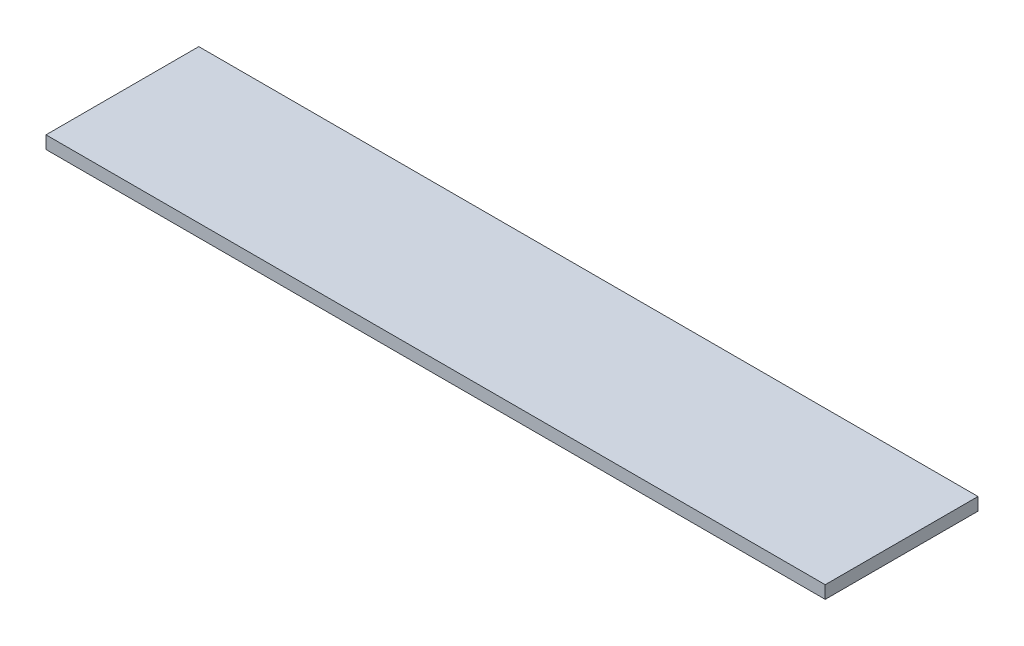
ISO-10303-21;
HEADER;
FILE_DESCRIPTION(('STEP AP214'),'2;1');
FILE_NAME('part.step','',(''),(''),'','','');
FILE_SCHEMA(('AUTOMOTIVE_DESIGN { 1 0 10303 214 1 1 1 1 }'));
ENDSEC;
DATA;
#1=APPLICATION_CONTEXT('core data for automotive mechanical design processes');
#2=APPLICATION_PROTOCOL_DEFINITION('international standard','automotive_design',2000,#1);
#3=PRODUCT_CONTEXT('',#1,'mechanical');
#4=PRODUCT('Part','Part','',(#3));
#5=PRODUCT_RELATED_PRODUCT_CATEGORY('part','',(#4));
#6=PRODUCT_DEFINITION_FORMATION('','',#4);
#7=PRODUCT_DEFINITION_CONTEXT('part definition',#1,'design');
#8=PRODUCT_DEFINITION('design','',#6,#7);
#9=PRODUCT_DEFINITION_SHAPE('','',#8);
#10=(LENGTH_UNIT() NAMED_UNIT(*) SI_UNIT(.MILLI.,.METRE.));
#11=(NAMED_UNIT(*) PLANE_ANGLE_UNIT() SI_UNIT($,.RADIAN.));
#12=(NAMED_UNIT(*) SI_UNIT($,.STERADIAN.) SOLID_ANGLE_UNIT());
#13=UNCERTAINTY_MEASURE_WITH_UNIT(LENGTH_MEASURE(1.E-05),#10,'distance_accuracy_value','');
#14=(GEOMETRIC_REPRESENTATION_CONTEXT(3) GLOBAL_UNCERTAINTY_ASSIGNED_CONTEXT((#13)) GLOBAL_UNIT_ASSIGNED_CONTEXT((#10,
#11,#12)) REPRESENTATION_CONTEXT('',''));
#15=CARTESIAN_POINT('',(0.,0.,0.));
#16=DIRECTION('',(0.,0.,1.));
#17=DIRECTION('',(1.,0.,0.));
#18=AXIS2_PLACEMENT_3D('',#15,#16,#17);
#19=CARTESIAN_POINT('',(-388.62,12.7,-76.2));
#20=DIRECTION('',(1.,0.,0.));
#21=DIRECTION('',(0.,0.,-1.));
#22=AXIS2_PLACEMENT_3D('',#19,#20,#21);
#23=PLANE('',#22);
#24=DIRECTION('',(0.,0.,1.));
#25=VECTOR('',#24,1.);
#26=CARTESIAN_POINT('',(-388.62,0.,-76.2));
#27=LINE('',#26,#25);
#28=CARTESIAN_POINT('',(-388.62,0.,-76.2));
#29=VERTEX_POINT('',#28);
#30=CARTESIAN_POINT('',(-388.62,0.,76.2));
#31=VERTEX_POINT('',#30);
#32=EDGE_CURVE('E111',#29,#31,#27,.T.);
#33=ORIENTED_EDGE('',*,*,#32,.T.);
#34=DIRECTION('',(0.,-1.,0.));
#35=VECTOR('',#34,1.);
#36=CARTESIAN_POINT('',(-388.62,12.7,76.2));
#37=LINE('',#36,#35);
#38=CARTESIAN_POINT('',(-388.62,12.7,76.2));
#39=VERTEX_POINT('',#38);
#40=EDGE_CURVE('E11',#39,#31,#37,.T.);
#41=ORIENTED_EDGE('',*,*,#40,.F.);
#42=DIRECTION('',(0.,0.,1.));
#43=VECTOR('',#42,1.);
#44=CARTESIAN_POINT('',(-388.62,12.7,-76.2));
#45=LINE('',#44,#43);
#46=CARTESIAN_POINT('',(-388.62,12.7,-76.2));
#47=VERTEX_POINT('',#46);
#48=EDGE_CURVE('E93',#47,#39,#45,.T.);
#49=ORIENTED_EDGE('',*,*,#48,.F.);
#50=DIRECTION('',(0.,-1.,0.));
#51=VECTOR('',#50,1.);
#52=CARTESIAN_POINT('',(-388.62,12.7,-76.2));
#53=LINE('',#52,#51);
#54=EDGE_CURVE('E60',#47,#29,#53,.T.);
#55=ORIENTED_EDGE('',*,*,#54,.T.);
#56=EDGE_LOOP('',(#33,#41,#49,#55));
#57=FACE_BOUND('',#56,.T.);
#58=ADVANCED_FACE('F43',(#57),#23,.F.);
#59=CARTESIAN_POINT('',(-388.62,12.7,76.2));
#60=DIRECTION('',(0.,0.,-1.));
#61=DIRECTION('',(-1.,0.,0.));
#62=AXIS2_PLACEMENT_3D('',#59,#60,#61);
#63=PLANE('',#62);
#64=DIRECTION('',(1.,0.,0.));
#65=VECTOR('',#64,1.);
#66=CARTESIAN_POINT('',(-388.62,0.,76.2));
#67=LINE('',#66,#65);
#68=CARTESIAN_POINT('',(388.62,0.,76.2));
#69=VERTEX_POINT('',#68);
#70=EDGE_CURVE('E99',#31,#69,#67,.T.);
#71=ORIENTED_EDGE('',*,*,#70,.T.);
#72=DIRECTION('',(0.,-1.,0.));
#73=VECTOR('',#72,1.);
#74=CARTESIAN_POINT('',(388.62,12.7,76.2));
#75=LINE('',#74,#73);
#76=CARTESIAN_POINT('',(388.62,12.7,76.2));
#77=VERTEX_POINT('',#76);
#78=EDGE_CURVE('E52',#77,#69,#75,.T.);
#79=ORIENTED_EDGE('',*,*,#78,.F.);
#80=DIRECTION('',(1.,0.,0.));
#81=VECTOR('',#80,1.);
#82=CARTESIAN_POINT('',(-388.62,12.7,76.2));
#83=LINE('',#82,#81);
#84=EDGE_CURVE('E85',#39,#77,#83,.T.);
#85=ORIENTED_EDGE('',*,*,#84,.F.);
#86=ORIENTED_EDGE('',*,*,#40,.T.);
#87=EDGE_LOOP('',(#71,#79,#85,#86));
#88=FACE_BOUND('',#87,.T.);
#89=ADVANCED_FACE('F98',(#88),#63,.F.);
#90=CARTESIAN_POINT('',(388.62,12.7,-76.2));
#91=DIRECTION('',(1.,0.,0.));
#92=DIRECTION('',(0.,0.,-1.));
#93=AXIS2_PLACEMENT_3D('',#90,#91,#92);
#94=PLANE('',#93);
#95=DIRECTION('',(0.,0.,1.));
#96=VECTOR('',#95,1.);
#97=CARTESIAN_POINT('',(388.62,0.,-76.2));
#98=LINE('',#97,#96);
#99=CARTESIAN_POINT('',(388.62,0.,-76.2));
#100=VERTEX_POINT('',#99);
#101=EDGE_CURVE('E116',#100,#69,#98,.T.);
#102=ORIENTED_EDGE('',*,*,#101,.F.);
#103=DIRECTION('',(0.,-1.,0.));
#104=VECTOR('',#103,1.);
#105=CARTESIAN_POINT('',(388.62,12.7,-76.2));
#106=LINE('',#105,#104);
#107=CARTESIAN_POINT('',(388.62,12.7,-76.2));
#108=VERTEX_POINT('',#107);
#109=EDGE_CURVE('E74',#108,#100,#106,.T.);
#110=ORIENTED_EDGE('',*,*,#109,.F.);
#111=DIRECTION('',(0.,0.,1.));
#112=VECTOR('',#111,1.);
#113=CARTESIAN_POINT('',(388.62,12.7,-76.2));
#114=LINE('',#113,#112);
#115=EDGE_CURVE('E92',#108,#77,#114,.T.);
#116=ORIENTED_EDGE('',*,*,#115,.T.);
#117=ORIENTED_EDGE('',*,*,#78,.T.);
#118=EDGE_LOOP('',(#102,#110,#116,#117));
#119=FACE_BOUND('',#118,.T.);
#120=ADVANCED_FACE('F103',(#119),#94,.T.);
#121=CARTESIAN_POINT('',(-388.62,12.7,-76.2));
#122=DIRECTION('',(0.,0.,-1.));
#123=DIRECTION('',(-1.,0.,0.));
#124=AXIS2_PLACEMENT_3D('',#121,#122,#123);
#125=PLANE('',#124);
#126=DIRECTION('',(1.,0.,0.));
#127=VECTOR('',#126,1.);
#128=CARTESIAN_POINT('',(-388.62,0.,-76.2));
#129=LINE('',#128,#127);
#130=EDGE_CURVE('E119',#29,#100,#129,.T.);
#131=ORIENTED_EDGE('',*,*,#130,.F.);
#132=ORIENTED_EDGE('',*,*,#54,.F.);
#133=DIRECTION('',(1.,0.,0.));
#134=VECTOR('',#133,1.);
#135=CARTESIAN_POINT('',(-388.62,12.7,-76.2));
#136=LINE('',#135,#134);
#137=EDGE_CURVE('E105',#47,#108,#136,.T.);
#138=ORIENTED_EDGE('',*,*,#137,.T.);
#139=ORIENTED_EDGE('',*,*,#109,.T.);
#140=EDGE_LOOP('',(#131,#132,#138,#139));
#141=FACE_BOUND('',#140,.T.);
#142=ADVANCED_FACE('F129',(#141),#125,.T.);
#143=CARTESIAN_POINT('',(0.,12.7,0.));
#144=DIRECTION('',(0.,1.,0.));
#145=DIRECTION('',(0.,0.,1.));
#146=AXIS2_PLACEMENT_3D('',#143,#144,#145);
#147=PLANE('',#146);
#148=ORIENTED_EDGE('',*,*,#48,.T.);
#149=ORIENTED_EDGE('',*,*,#84,.T.);
#150=ORIENTED_EDGE('',*,*,#115,.F.);
#151=ORIENTED_EDGE('',*,*,#137,.F.);
#152=EDGE_LOOP('',(#148,#149,#150,#151));
#153=FACE_BOUND('',#152,.T.);
#154=ADVANCED_FACE('F89',(#153),#147,.T.);
#155=CARTESIAN_POINT('',(0.,0.,0.));
#156=DIRECTION('',(0.,1.,0.));
#157=DIRECTION('',(0.,0.,1.));
#158=AXIS2_PLACEMENT_3D('',#155,#156,#157);
#159=PLANE('',#158);
#160=ORIENTED_EDGE('',*,*,#32,.F.);
#161=ORIENTED_EDGE('',*,*,#130,.T.);
#162=ORIENTED_EDGE('',*,*,#101,.T.);
#163=ORIENTED_EDGE('',*,*,#70,.F.);
#164=EDGE_LOOP('',(#160,#161,#162,#163));
#165=FACE_BOUND('',#164,.T.);
#166=ADVANCED_FACE('F128',(#165),#159,.F.);
#167=CLOSED_SHELL('',(#58,#89,#120,#142,#154,#166));
#168=MANIFOLD_SOLID_BREP('B2',#167);
#169=ADVANCED_BREP_SHAPE_REPRESENTATION('',(#18,#168),#14);
#170=SHAPE_DEFINITION_REPRESENTATION(#9,#169);
ENDSEC;
END-ISO-10303-21;
